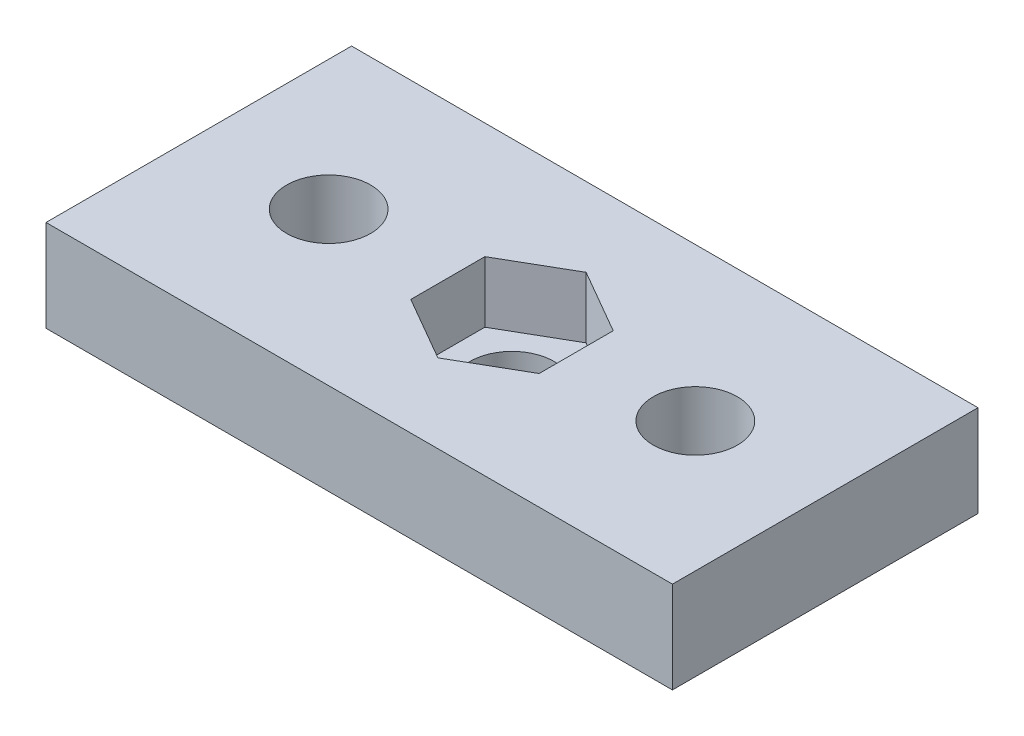
ISO-10303-21;
HEADER;
FILE_DESCRIPTION(('STEP AP214'),'2;1');
FILE_NAME('part.step','',(''),(''),'','','');
FILE_SCHEMA(('AUTOMOTIVE_DESIGN { 1 0 10303 214 1 1 1 1 }'));
ENDSEC;
DATA;
#1=APPLICATION_CONTEXT('core data for automotive mechanical design processes');
#2=APPLICATION_PROTOCOL_DEFINITION('international standard','automotive_design',2000,#1);
#3=PRODUCT_CONTEXT('',#1,'mechanical');
#4=PRODUCT('Part','Part','',(#3));
#5=PRODUCT_RELATED_PRODUCT_CATEGORY('part','',(#4));
#6=PRODUCT_DEFINITION_FORMATION('','',#4);
#7=PRODUCT_DEFINITION_CONTEXT('part definition',#1,'design');
#8=PRODUCT_DEFINITION('design','',#6,#7);
#9=PRODUCT_DEFINITION_SHAPE('','',#8);
#10=(LENGTH_UNIT() NAMED_UNIT(*) SI_UNIT(.MILLI.,.METRE.));
#11=(NAMED_UNIT(*) PLANE_ANGLE_UNIT() SI_UNIT($,.RADIAN.));
#12=(NAMED_UNIT(*) SI_UNIT($,.STERADIAN.) SOLID_ANGLE_UNIT());
#13=UNCERTAINTY_MEASURE_WITH_UNIT(LENGTH_MEASURE(1.E-05),#10,'distance_accuracy_value','');
#14=(GEOMETRIC_REPRESENTATION_CONTEXT(3) GLOBAL_UNCERTAINTY_ASSIGNED_CONTEXT((#13)) GLOBAL_UNIT_ASSIGNED_CONTEXT((#10,
#11,#12)) REPRESENTATION_CONTEXT('',''));
#15=CARTESIAN_POINT('',(0.,0.,0.));
#16=DIRECTION('',(0.,0.,1.));
#17=DIRECTION('',(1.,0.,0.));
#18=AXIS2_PLACEMENT_3D('',#15,#16,#17);
#19=CARTESIAN_POINT('',(41.,-6.,-20.));
#20=DIRECTION('',(0.,0.,-1.));
#21=DIRECTION('',(-1.,0.,0.));
#22=AXIS2_PLACEMENT_3D('',#19,#20,#21);
#23=PLANE('',#22);
#24=DIRECTION('',(-1.,0.,0.));
#25=VECTOR('',#24,1.);
#26=CARTESIAN_POINT('',(41.,0.,-20.));
#27=LINE('',#26,#25);
#28=CARTESIAN_POINT('',(41.,0.,-20.));
#29=VERTEX_POINT('',#28);
#30=CARTESIAN_POINT('',(0.,0.,-20.));
#31=VERTEX_POINT('',#30);
#32=EDGE_CURVE('E168',#29,#31,#27,.T.);
#33=ORIENTED_EDGE('',*,*,#32,.F.);
#34=DIRECTION('',(0.,1.,0.));
#35=VECTOR('',#34,1.);
#36=CARTESIAN_POINT('',(41.,-6.,-20.));
#37=LINE('',#36,#35);
#38=CARTESIAN_POINT('',(41.,-6.,-20.));
#39=VERTEX_POINT('',#38);
#40=EDGE_CURVE('E11',#39,#29,#37,.T.);
#41=ORIENTED_EDGE('',*,*,#40,.F.);
#42=DIRECTION('',(-1.,0.,0.));
#43=VECTOR('',#42,1.);
#44=CARTESIAN_POINT('',(41.,-6.,-20.));
#45=LINE('',#44,#43);
#46=CARTESIAN_POINT('',(0.,-6.,-20.));
#47=VERTEX_POINT('',#46);
#48=EDGE_CURVE('E176',#39,#47,#45,.T.);
#49=ORIENTED_EDGE('',*,*,#48,.T.);
#50=DIRECTION('',(0.,1.,0.));
#51=VECTOR('',#50,1.);
#52=CARTESIAN_POINT('',(0.,-6.,-20.));
#53=LINE('',#52,#51);
#54=EDGE_CURVE('E81',#47,#31,#53,.T.);
#55=ORIENTED_EDGE('',*,*,#54,.T.);
#56=EDGE_LOOP('',(#33,#41,#49,#55));
#57=FACE_BOUND('',#56,.T.);
#58=ADVANCED_FACE('F32',(#57),#23,.T.);
#59=CARTESIAN_POINT('',(41.,-6.,0.));
#60=DIRECTION('',(1.,0.,0.));
#61=DIRECTION('',(0.,0.,-1.));
#62=AXIS2_PLACEMENT_3D('',#59,#60,#61);
#63=PLANE('',#62);
#64=DIRECTION('',(0.,0.,-1.));
#65=VECTOR('',#64,1.);
#66=CARTESIAN_POINT('',(41.,0.,0.));
#67=LINE('',#66,#65);
#68=CARTESIAN_POINT('',(41.,0.,0.));
#69=VERTEX_POINT('',#68);
#70=EDGE_CURVE('E179',#69,#29,#67,.T.);
#71=ORIENTED_EDGE('',*,*,#70,.F.);
#72=DIRECTION('',(0.,1.,0.));
#73=VECTOR('',#72,1.);
#74=CARTESIAN_POINT('',(41.,-6.,0.));
#75=LINE('',#74,#73);
#76=CARTESIAN_POINT('',(41.,-6.,0.));
#77=VERTEX_POINT('',#76);
#78=EDGE_CURVE('E40',#77,#69,#75,.T.);
#79=ORIENTED_EDGE('',*,*,#78,.F.);
#80=DIRECTION('',(0.,0.,-1.));
#81=VECTOR('',#80,1.);
#82=CARTESIAN_POINT('',(41.,-6.,0.));
#83=LINE('',#82,#81);
#84=EDGE_CURVE('E184',#77,#39,#83,.T.);
#85=ORIENTED_EDGE('',*,*,#84,.T.);
#86=ORIENTED_EDGE('',*,*,#40,.T.);
#87=EDGE_LOOP('',(#71,#79,#85,#86));
#88=FACE_BOUND('',#87,.T.);
#89=ADVANCED_FACE('F202',(#88),#63,.T.);
#90=CARTESIAN_POINT('',(0.,-6.,0.));
#91=DIRECTION('',(0.,0.,1.));
#92=DIRECTION('',(1.,0.,0.));
#93=AXIS2_PLACEMENT_3D('',#90,#91,#92);
#94=PLANE('',#93);
#95=DIRECTION('',(1.,0.,0.));
#96=VECTOR('',#95,1.);
#97=CARTESIAN_POINT('',(0.,0.,0.));
#98=LINE('',#97,#96);
#99=CARTESIAN_POINT('',(0.,0.,0.));
#100=VERTEX_POINT('',#99);
#101=EDGE_CURVE('E191',#100,#69,#98,.T.);
#102=ORIENTED_EDGE('',*,*,#101,.F.);
#103=DIRECTION('',(0.,1.,0.));
#104=VECTOR('',#103,1.);
#105=CARTESIAN_POINT('',(0.,-6.,0.));
#106=LINE('',#105,#104);
#107=CARTESIAN_POINT('',(0.,-6.,0.));
#108=VERTEX_POINT('',#107);
#109=EDGE_CURVE('E197',#108,#100,#106,.T.);
#110=ORIENTED_EDGE('',*,*,#109,.F.);
#111=DIRECTION('',(1.,0.,0.));
#112=VECTOR('',#111,1.);
#113=CARTESIAN_POINT('',(0.,-6.,0.));
#114=LINE('',#113,#112);
#115=EDGE_CURVE('E181',#108,#77,#114,.T.);
#116=ORIENTED_EDGE('',*,*,#115,.T.);
#117=ORIENTED_EDGE('',*,*,#78,.T.);
#118=EDGE_LOOP('',(#102,#110,#116,#117));
#119=FACE_BOUND('',#118,.T.);
#120=ADVANCED_FACE('F206',(#119),#94,.T.);
#121=CARTESIAN_POINT('',(0.,-6.,-20.));
#122=DIRECTION('',(-1.,0.,0.));
#123=DIRECTION('',(0.,0.,1.));
#124=AXIS2_PLACEMENT_3D('',#121,#122,#123);
#125=PLANE('',#124);
#126=DIRECTION('',(0.,0.,1.));
#127=VECTOR('',#126,1.);
#128=CARTESIAN_POINT('',(0.,0.,-20.));
#129=LINE('',#128,#127);
#130=EDGE_CURVE('E188',#31,#100,#129,.T.);
#131=ORIENTED_EDGE('',*,*,#130,.F.);
#132=ORIENTED_EDGE('',*,*,#54,.F.);
#133=DIRECTION('',(0.,0.,1.));
#134=VECTOR('',#133,1.);
#135=CARTESIAN_POINT('',(0.,-6.,-20.));
#136=LINE('',#135,#134);
#137=EDGE_CURVE('E178',#47,#108,#136,.T.);
#138=ORIENTED_EDGE('',*,*,#137,.T.);
#139=ORIENTED_EDGE('',*,*,#109,.T.);
#140=EDGE_LOOP('',(#131,#132,#138,#139));
#141=FACE_BOUND('',#140,.T.);
#142=ADVANCED_FACE('F198',(#141),#125,.T.);
#143=CARTESIAN_POINT('',(0.,-6.,0.));
#144=DIRECTION('',(0.,1.,0.));
#145=DIRECTION('',(0.,0.,1.));
#146=AXIS2_PLACEMENT_3D('',#143,#144,#145);
#147=PLANE('',#146);
#148=CARTESIAN_POINT('',(20.5,-6.,-10.));
#149=DIRECTION('',(0.,1.,0.));
#150=DIRECTION('',(0.,0.,1.));
#151=AXIS2_PLACEMENT_3D('',#148,#149,#150);
#152=CIRCLE('',#151,2.75);
#153=CARTESIAN_POINT('',(20.5,-6.,-7.25));
#154=VERTEX_POINT('',#153);
#155=EDGE_CURVE('E348',#154,#154,#152,.T.);
#156=ORIENTED_EDGE('',*,*,#155,.T.);
#157=EDGE_LOOP('',(#156));
#158=FACE_BOUND('',#157,.T.);
#159=CARTESIAN_POINT('',(32.5,-6.,-10.));
#160=DIRECTION('',(0.,1.,0.));
#161=DIRECTION('',(0.,0.,1.));
#162=AXIS2_PLACEMENT_3D('',#159,#160,#161);
#163=CIRCLE('',#162,2.75);
#164=CARTESIAN_POINT('',(32.5,-6.,-7.25));
#165=VERTEX_POINT('',#164);
#166=EDGE_CURVE('E352',#165,#165,#163,.T.);
#167=ORIENTED_EDGE('',*,*,#166,.T.);
#168=EDGE_LOOP('',(#167));
#169=FACE_BOUND('',#168,.T.);
#170=CARTESIAN_POINT('',(8.50000000000001,-6.,-10.));
#171=DIRECTION('',(0.,1.,0.));
#172=DIRECTION('',(0.,0.,1.));
#173=AXIS2_PLACEMENT_3D('',#170,#171,#172);
#174=CIRCLE('',#173,2.75);
#175=CARTESIAN_POINT('',(8.50000000000001,-6.,-7.25));
#176=VERTEX_POINT('',#175);
#177=EDGE_CURVE('E156',#176,#176,#174,.T.);
#178=ORIENTED_EDGE('',*,*,#177,.T.);
#179=EDGE_LOOP('',(#178));
#180=FACE_BOUND('',#179,.T.);
#181=ORIENTED_EDGE('',*,*,#48,.F.);
#182=ORIENTED_EDGE('',*,*,#84,.F.);
#183=ORIENTED_EDGE('',*,*,#115,.F.);
#184=ORIENTED_EDGE('',*,*,#137,.F.);
#185=EDGE_LOOP('',(#181,#182,#183,#184));
#186=FACE_BOUND('',#185,.T.);
#187=ADVANCED_FACE('F208',(#158,#169,#180,#186),#147,.F.);
#188=CARTESIAN_POINT('',(0.,0.,0.));
#189=DIRECTION('',(0.,1.,0.));
#190=DIRECTION('',(0.,0.,1.));
#191=AXIS2_PLACEMENT_3D('',#188,#189,#190);
#192=PLANE('',#191);
#193=CARTESIAN_POINT('',(32.5,0.,-10.));
#194=DIRECTION('',(0.,1.,0.));
#195=DIRECTION('',(0.,0.,1.));
#196=AXIS2_PLACEMENT_3D('',#193,#194,#195);
#197=CIRCLE('',#196,2.75);
#198=CARTESIAN_POINT('',(32.5,0.,-7.25));
#199=VERTEX_POINT('',#198);
#200=EDGE_CURVE('E350',#199,#199,#197,.T.);
#201=ORIENTED_EDGE('',*,*,#200,.F.);
#202=EDGE_LOOP('',(#201));
#203=FACE_BOUND('',#202,.T.);
#204=CARTESIAN_POINT('',(8.50000000000001,0.,-10.));
#205=DIRECTION('',(0.,1.,0.));
#206=DIRECTION('',(0.,0.,1.));
#207=AXIS2_PLACEMENT_3D('',#204,#205,#206);
#208=CIRCLE('',#207,2.75);
#209=CARTESIAN_POINT('',(8.50000000000001,0.,-7.25));
#210=VERTEX_POINT('',#209);
#211=EDGE_CURVE('E144',#210,#210,#208,.T.);
#212=ORIENTED_EDGE('',*,*,#211,.F.);
#213=EDGE_LOOP('',(#212));
#214=FACE_BOUND('',#213,.T.);
#215=DIRECTION('',(0.866025403784439,0.,0.5));
#216=VECTOR('',#215,1.);
#217=CARTESIAN_POINT('',(16.3,0.,-7.57512886940358));
#218=LINE('',#217,#216);
#219=CARTESIAN_POINT('',(16.3,0.,-7.57512886940358));
#220=VERTEX_POINT('',#219);
#221=CARTESIAN_POINT('',(20.5,0.,-5.15025773880715));
#222=VERTEX_POINT('',#221);
#223=EDGE_CURVE('E48',#220,#222,#218,.T.);
#224=ORIENTED_EDGE('',*,*,#223,.F.);
#225=DIRECTION('',(0.,0.,1.));
#226=VECTOR('',#225,1.);
#227=CARTESIAN_POINT('',(16.3,0.,-12.4248711305964));
#228=LINE('',#227,#226);
#229=CARTESIAN_POINT('',(16.3,0.,-12.4248711305964));
#230=VERTEX_POINT('',#229);
#231=EDGE_CURVE('E138',#230,#220,#228,.T.);
#232=ORIENTED_EDGE('',*,*,#231,.F.);
#233=DIRECTION('',(-0.866025403784439,0.,0.5));
#234=VECTOR('',#233,1.);
#235=CARTESIAN_POINT('',(20.5,0.,-14.8497422611929));
#236=LINE('',#235,#234);
#237=CARTESIAN_POINT('',(20.5,0.,-14.8497422611929));
#238=VERTEX_POINT('',#237);
#239=EDGE_CURVE('E141',#238,#230,#236,.T.);
#240=ORIENTED_EDGE('',*,*,#239,.F.);
#241=DIRECTION('',(-0.866025403784439,0.,-0.5));
#242=VECTOR('',#241,1.);
#243=CARTESIAN_POINT('',(24.7,0.,-12.4248711305964));
#244=LINE('',#243,#242);
#245=CARTESIAN_POINT('',(24.7,0.,-12.4248711305964));
#246=VERTEX_POINT('',#245);
#247=EDGE_CURVE('E161',#246,#238,#244,.T.);
#248=ORIENTED_EDGE('',*,*,#247,.F.);
#249=DIRECTION('',(0.,0.,-1.));
#250=VECTOR('',#249,1.);
#251=CARTESIAN_POINT('',(24.7,0.,-7.57512886940357));
#252=LINE('',#251,#250);
#253=CARTESIAN_POINT('',(24.7,0.,-7.57512886940357));
#254=VERTEX_POINT('',#253);
#255=EDGE_CURVE('E158',#254,#246,#252,.T.);
#256=ORIENTED_EDGE('',*,*,#255,.F.);
#257=DIRECTION('',(0.866025403784439,0.,-0.5));
#258=VECTOR('',#257,1.);
#259=CARTESIAN_POINT('',(20.5,0.,-5.15025773880715));
#260=LINE('',#259,#258);
#261=EDGE_CURVE('E155',#222,#254,#260,.T.);
#262=ORIENTED_EDGE('',*,*,#261,.F.);
#263=EDGE_LOOP('',(#224,#232,#240,#248,#256,#262));
#264=FACE_BOUND('',#263,.T.);
#265=ORIENTED_EDGE('',*,*,#32,.T.);
#266=ORIENTED_EDGE('',*,*,#130,.T.);
#267=ORIENTED_EDGE('',*,*,#101,.T.);
#268=ORIENTED_EDGE('',*,*,#70,.T.);
#269=EDGE_LOOP('',(#265,#266,#267,#268));
#270=FACE_BOUND('',#269,.T.);
#271=ADVANCED_FACE('F201',(#203,#214,#264,#270),#192,.T.);
#272=CARTESIAN_POINT('',(16.3,-4.,-7.57512886940358));
#273=DIRECTION('',(-0.5,0.,0.866025403784439));
#274=DIRECTION('',(0.866025403784439,0.,0.5));
#275=AXIS2_PLACEMENT_3D('',#272,#273,#274);
#276=PLANE('',#275);
#277=ORIENTED_EDGE('',*,*,#223,.T.);
#278=DIRECTION('',(0.,1.,0.));
#279=VECTOR('',#278,1.);
#280=CARTESIAN_POINT('',(20.5,-4.,-5.15025773880715));
#281=LINE('',#280,#279);
#282=CARTESIAN_POINT('',(20.5,-4.,-5.15025773880715));
#283=VERTEX_POINT('',#282);
#284=EDGE_CURVE('E115',#283,#222,#281,.T.);
#285=ORIENTED_EDGE('',*,*,#284,.F.);
#286=DIRECTION('',(0.866025403784439,0.,0.5));
#287=VECTOR('',#286,1.);
#288=CARTESIAN_POINT('',(16.3,-4.,-7.57512886940358));
#289=LINE('',#288,#287);
#290=CARTESIAN_POINT('',(16.3,-4.,-7.57512886940358));
#291=VERTEX_POINT('',#290);
#292=EDGE_CURVE('E119',#291,#283,#289,.T.);
#293=ORIENTED_EDGE('',*,*,#292,.F.);
#294=DIRECTION('',(0.,1.,0.));
#295=VECTOR('',#294,1.);
#296=CARTESIAN_POINT('',(16.3,-4.,-7.57512886940358));
#297=LINE('',#296,#295);
#298=EDGE_CURVE('E166',#291,#220,#297,.T.);
#299=ORIENTED_EDGE('',*,*,#298,.T.);
#300=EDGE_LOOP('',(#277,#285,#293,#299));
#301=FACE_BOUND('',#300,.T.);
#302=ADVANCED_FACE('F117',(#301),#276,.F.);
#303=CARTESIAN_POINT('',(16.3,-4.,-12.4248711305964));
#304=DIRECTION('',(-1.,0.,0.));
#305=DIRECTION('',(0.,0.,1.));
#306=AXIS2_PLACEMENT_3D('',#303,#304,#305);
#307=PLANE('',#306);
#308=ORIENTED_EDGE('',*,*,#231,.T.);
#309=ORIENTED_EDGE('',*,*,#298,.F.);
#310=DIRECTION('',(0.,0.,1.));
#311=VECTOR('',#310,1.);
#312=CARTESIAN_POINT('',(16.3,-4.,-12.4248711305964));
#313=LINE('',#312,#311);
#314=CARTESIAN_POINT('',(16.3,-4.,-12.4248711305964));
#315=VERTEX_POINT('',#314);
#316=EDGE_CURVE('E125',#315,#291,#313,.T.);
#317=ORIENTED_EDGE('',*,*,#316,.F.);
#318=DIRECTION('',(0.,1.,0.));
#319=VECTOR('',#318,1.);
#320=CARTESIAN_POINT('',(16.3,-4.,-12.4248711305964));
#321=LINE('',#320,#319);
#322=EDGE_CURVE('E169',#315,#230,#321,.T.);
#323=ORIENTED_EDGE('',*,*,#322,.T.);
#324=EDGE_LOOP('',(#308,#309,#317,#323));
#325=FACE_BOUND('',#324,.T.);
#326=ADVANCED_FACE('F246',(#325),#307,.F.);
#327=CARTESIAN_POINT('',(20.5,-4.,-14.8497422611929));
#328=DIRECTION('',(-0.5,0.,-0.866025403784439));
#329=DIRECTION('',(-0.866025403784439,0.,0.5));
#330=AXIS2_PLACEMENT_3D('',#327,#328,#329);
#331=PLANE('',#330);
#332=ORIENTED_EDGE('',*,*,#239,.T.);
#333=ORIENTED_EDGE('',*,*,#322,.F.);
#334=DIRECTION('',(-0.866025403784439,0.,0.5));
#335=VECTOR('',#334,1.);
#336=CARTESIAN_POINT('',(20.5,-4.,-14.8497422611929));
#337=LINE('',#336,#335);
#338=CARTESIAN_POINT('',(20.5,-4.,-14.8497422611929));
#339=VERTEX_POINT('',#338);
#340=EDGE_CURVE('E151',#339,#315,#337,.T.);
#341=ORIENTED_EDGE('',*,*,#340,.F.);
#342=DIRECTION('',(0.,1.,0.));
#343=VECTOR('',#342,1.);
#344=CARTESIAN_POINT('',(20.5,-4.,-14.8497422611929));
#345=LINE('',#344,#343);
#346=EDGE_CURVE('E171',#339,#238,#345,.T.);
#347=ORIENTED_EDGE('',*,*,#346,.T.);
#348=EDGE_LOOP('',(#332,#333,#341,#347));
#349=FACE_BOUND('',#348,.T.);
#350=ADVANCED_FACE('F255',(#349),#331,.F.);
#351=CARTESIAN_POINT('',(24.7,-4.,-12.4248711305964));
#352=DIRECTION('',(0.5,0.,-0.866025403784438));
#353=DIRECTION('',(-0.866025403784439,0.,-0.5));
#354=AXIS2_PLACEMENT_3D('',#351,#352,#353);
#355=PLANE('',#354);
#356=ORIENTED_EDGE('',*,*,#247,.T.);
#357=ORIENTED_EDGE('',*,*,#346,.F.);
#358=DIRECTION('',(-0.866025403784439,0.,-0.5));
#359=VECTOR('',#358,1.);
#360=CARTESIAN_POINT('',(24.7,-4.,-12.4248711305964));
#361=LINE('',#360,#359);
#362=CARTESIAN_POINT('',(24.7,-4.,-12.4248711305964));
#363=VERTEX_POINT('',#362);
#364=EDGE_CURVE('E148',#363,#339,#361,.T.);
#365=ORIENTED_EDGE('',*,*,#364,.F.);
#366=DIRECTION('',(0.,1.,0.));
#367=VECTOR('',#366,1.);
#368=CARTESIAN_POINT('',(24.7,-4.,-12.4248711305964));
#369=LINE('',#368,#367);
#370=EDGE_CURVE('E173',#363,#246,#369,.T.);
#371=ORIENTED_EDGE('',*,*,#370,.T.);
#372=EDGE_LOOP('',(#356,#357,#365,#371));
#373=FACE_BOUND('',#372,.T.);
#374=ADVANCED_FACE('F265',(#373),#355,.F.);
#375=CARTESIAN_POINT('',(24.7,-4.,-7.57512886940357));
#376=DIRECTION('',(1.,0.,0.));
#377=DIRECTION('',(0.,0.,-1.));
#378=AXIS2_PLACEMENT_3D('',#375,#376,#377);
#379=PLANE('',#378);
#380=ORIENTED_EDGE('',*,*,#255,.T.);
#381=ORIENTED_EDGE('',*,*,#370,.F.);
#382=DIRECTION('',(0.,0.,-1.));
#383=VECTOR('',#382,1.);
#384=CARTESIAN_POINT('',(24.7,-4.,-7.57512886940357));
#385=LINE('',#384,#383);
#386=CARTESIAN_POINT('',(24.7,-4.,-7.57512886940357));
#387=VERTEX_POINT('',#386);
#388=EDGE_CURVE('E133',#387,#363,#385,.T.);
#389=ORIENTED_EDGE('',*,*,#388,.F.);
#390=DIRECTION('',(0.,1.,0.));
#391=VECTOR('',#390,1.);
#392=CARTESIAN_POINT('',(24.7,-4.,-7.57512886940357));
#393=LINE('',#392,#391);
#394=EDGE_CURVE('E124',#387,#254,#393,.T.);
#395=ORIENTED_EDGE('',*,*,#394,.T.);
#396=EDGE_LOOP('',(#380,#381,#389,#395));
#397=FACE_BOUND('',#396,.T.);
#398=ADVANCED_FACE('F275',(#397),#379,.F.);
#399=CARTESIAN_POINT('',(20.5,-4.,-5.15025773880715));
#400=DIRECTION('',(0.5,0.,0.866025403784438));
#401=DIRECTION('',(0.866025403784439,0.,-0.5));
#402=AXIS2_PLACEMENT_3D('',#399,#400,#401);
#403=PLANE('',#402);
#404=ORIENTED_EDGE('',*,*,#261,.T.);
#405=ORIENTED_EDGE('',*,*,#394,.F.);
#406=DIRECTION('',(0.866025403784439,0.,-0.5));
#407=VECTOR('',#406,1.);
#408=CARTESIAN_POINT('',(20.5,-4.,-5.15025773880715));
#409=LINE('',#408,#407);
#410=EDGE_CURVE('E128',#283,#387,#409,.T.);
#411=ORIENTED_EDGE('',*,*,#410,.F.);
#412=ORIENTED_EDGE('',*,*,#284,.T.);
#413=EDGE_LOOP('',(#404,#405,#411,#412));
#414=FACE_BOUND('',#413,.T.);
#415=ADVANCED_FACE('F129',(#414),#403,.F.);
#416=CARTESIAN_POINT('',(0.,-4.,0.));
#417=DIRECTION('',(0.,1.,0.));
#418=DIRECTION('',(0.,0.,1.));
#419=AXIS2_PLACEMENT_3D('',#416,#417,#418);
#420=PLANE('',#419);
#421=CARTESIAN_POINT('',(20.5,-4.,-10.));
#422=DIRECTION('',(0.,1.,0.));
#423=DIRECTION('',(0.,0.,1.));
#424=AXIS2_PLACEMENT_3D('',#421,#422,#423);
#425=CIRCLE('',#424,2.75);
#426=CARTESIAN_POINT('',(20.5,-4.,-7.25));
#427=VERTEX_POINT('',#426);
#428=EDGE_CURVE('E35',#427,#427,#425,.T.);
#429=ORIENTED_EDGE('',*,*,#428,.F.);
#430=EDGE_LOOP('',(#429));
#431=FACE_BOUND('',#430,.T.);
#432=ORIENTED_EDGE('',*,*,#292,.T.);
#433=ORIENTED_EDGE('',*,*,#410,.T.);
#434=ORIENTED_EDGE('',*,*,#388,.T.);
#435=ORIENTED_EDGE('',*,*,#364,.T.);
#436=ORIENTED_EDGE('',*,*,#340,.T.);
#437=ORIENTED_EDGE('',*,*,#316,.T.);
#438=EDGE_LOOP('',(#432,#433,#434,#435,#436,#437));
#439=FACE_BOUND('',#438,.T.);
#440=ADVANCED_FACE('F135',(#431,#439),#420,.T.);
#441=CARTESIAN_POINT('',(8.50000000000001,-6.,-10.));
#442=DIRECTION('',(0.,1.,0.));
#443=DIRECTION('',(0.,0.,1.));
#444=AXIS2_PLACEMENT_3D('',#441,#442,#443);
#445=CYLINDRICAL_SURFACE('',#444,2.75);
#446=ORIENTED_EDGE('',*,*,#177,.F.);
#447=EDGE_LOOP('',(#446));
#448=FACE_BOUND('',#447,.T.);
#449=ORIENTED_EDGE('',*,*,#211,.T.);
#450=EDGE_LOOP('',(#449));
#451=FACE_BOUND('',#450,.T.);
#452=ADVANCED_FACE('F310',(#448,#451),#445,.F.);
#453=CARTESIAN_POINT('',(32.5,-6.,-10.));
#454=DIRECTION('',(0.,1.,0.));
#455=DIRECTION('',(0.,0.,1.));
#456=AXIS2_PLACEMENT_3D('',#453,#454,#455);
#457=CYLINDRICAL_SURFACE('',#456,2.75);
#458=ORIENTED_EDGE('',*,*,#166,.F.);
#459=EDGE_LOOP('',(#458));
#460=FACE_BOUND('',#459,.T.);
#461=ORIENTED_EDGE('',*,*,#200,.T.);
#462=EDGE_LOOP('',(#461));
#463=FACE_BOUND('',#462,.T.);
#464=ADVANCED_FACE('F320',(#460,#463),#457,.F.);
#465=CARTESIAN_POINT('',(20.5,-6.,-10.));
#466=DIRECTION('',(0.,1.,0.));
#467=DIRECTION('',(0.,0.,1.));
#468=AXIS2_PLACEMENT_3D('',#465,#466,#467);
#469=CYLINDRICAL_SURFACE('',#468,2.75);
#470=ORIENTED_EDGE('',*,*,#428,.T.);
#471=EDGE_LOOP('',(#470));
#472=FACE_BOUND('',#471,.T.);
#473=ORIENTED_EDGE('',*,*,#155,.F.);
#474=EDGE_LOOP('',(#473));
#475=FACE_BOUND('',#474,.T.);
#476=ADVANCED_FACE('F330',(#472,#475),#469,.F.);
#477=CLOSED_SHELL('',(#58,#89,#120,#142,#187,#271,#302,#326,#350,#374,#398,#415,#440,#452,#464,#476));
#478=MANIFOLD_SOLID_BREP('B2',#477);
#479=ADVANCED_BREP_SHAPE_REPRESENTATION('',(#18,#478),#14);
#480=SHAPE_DEFINITION_REPRESENTATION(#9,#479);
ENDSEC;
END-ISO-10303-21;
